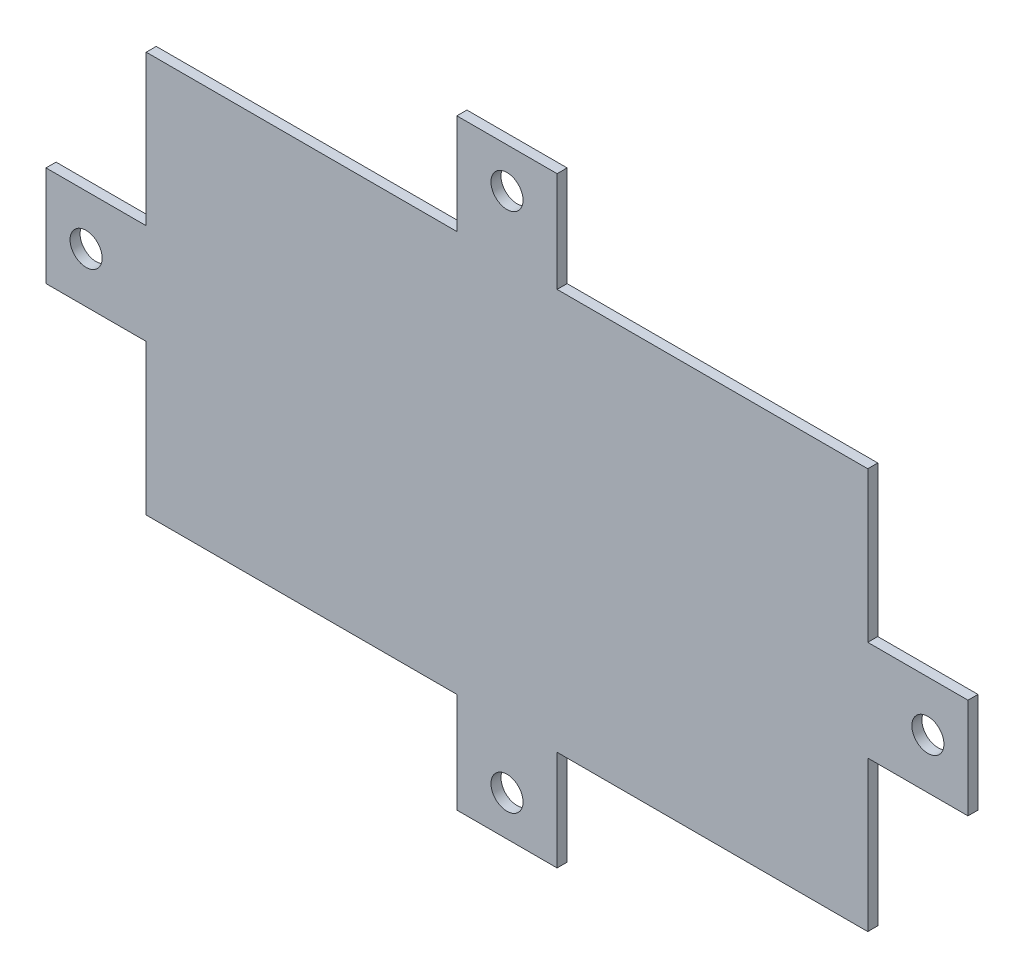
ISO-10303-21;
HEADER;
FILE_DESCRIPTION(('STEP AP214'),'2;1');
FILE_NAME('part.step','',(''),(''),'','','');
FILE_SCHEMA(('AUTOMOTIVE_DESIGN { 1 0 10303 214 1 1 1 1 }'));
ENDSEC;
DATA;
#1=APPLICATION_CONTEXT('core data for automotive mechanical design processes');
#2=APPLICATION_PROTOCOL_DEFINITION('international standard','automotive_design',2000,#1);
#3=PRODUCT_CONTEXT('',#1,'mechanical');
#4=PRODUCT('Part','Part','',(#3));
#5=PRODUCT_RELATED_PRODUCT_CATEGORY('part','',(#4));
#6=PRODUCT_DEFINITION_FORMATION('','',#4);
#7=PRODUCT_DEFINITION_CONTEXT('part definition',#1,'design');
#8=PRODUCT_DEFINITION('design','',#6,#7);
#9=PRODUCT_DEFINITION_SHAPE('','',#8);
#10=(LENGTH_UNIT() NAMED_UNIT(*) SI_UNIT(.MILLI.,.METRE.));
#11=(NAMED_UNIT(*) PLANE_ANGLE_UNIT() SI_UNIT($,.RADIAN.));
#12=(NAMED_UNIT(*) SI_UNIT($,.STERADIAN.) SOLID_ANGLE_UNIT());
#13=UNCERTAINTY_MEASURE_WITH_UNIT(LENGTH_MEASURE(1.E-05),#10,'distance_accuracy_value','');
#14=(GEOMETRIC_REPRESENTATION_CONTEXT(3) GLOBAL_UNCERTAINTY_ASSIGNED_CONTEXT((#13)) GLOBAL_UNIT_ASSIGNED_CONTEXT((#10,
#11,#12)) REPRESENTATION_CONTEXT('',''));
#15=CARTESIAN_POINT('',(0.,0.,0.));
#16=DIRECTION('',(0.,0.,1.));
#17=DIRECTION('',(1.,0.,0.));
#18=AXIS2_PLACEMENT_3D('',#15,#16,#17);
#19=CARTESIAN_POINT('',(0.,0.,0.));
#20=DIRECTION('',(0.,0.,1.));
#21=DIRECTION('',(1.,0.,0.));
#22=AXIS2_PLACEMENT_3D('',#19,#20,#21);
#23=PLANE('',#22);
#24=CARTESIAN_POINT('',(0.,26.,0.));
#25=DIRECTION('',(0.,0.,-1.));
#26=DIRECTION('',(-1.,0.,0.));
#27=AXIS2_PLACEMENT_3D('',#24,#25,#26);
#28=CIRCLE('',#27,1.6);
#29=CARTESIAN_POINT('',(-1.6,26.,0.));
#30=VERTEX_POINT('',#29);
#31=EDGE_CURVE('E185',#30,#30,#28,.F.);
#32=ORIENTED_EDGE('',*,*,#31,.T.);
#33=EDGE_LOOP('',(#32));
#34=FACE_BOUND('',#33,.T.);
#35=CARTESIAN_POINT('',(0.,-26.,0.));
#36=DIRECTION('',(0.,0.,-1.));
#37=DIRECTION('',(-1.,0.,0.));
#38=AXIS2_PLACEMENT_3D('',#35,#36,#37);
#39=CIRCLE('',#38,1.6);
#40=CARTESIAN_POINT('',(-1.6,-26.,0.));
#41=VERTEX_POINT('',#40);
#42=EDGE_CURVE('E189',#41,#41,#39,.F.);
#43=ORIENTED_EDGE('',*,*,#42,.T.);
#44=EDGE_LOOP('',(#43));
#45=FACE_BOUND('',#44,.T.);
#46=CARTESIAN_POINT('',(-42.,0.,0.));
#47=DIRECTION('',(0.,0.,-1.));
#48=DIRECTION('',(-1.,0.,0.));
#49=AXIS2_PLACEMENT_3D('',#46,#47,#48);
#50=CIRCLE('',#49,1.6);
#51=CARTESIAN_POINT('',(-43.6,0.,0.));
#52=VERTEX_POINT('',#51);
#53=EDGE_CURVE('E191',#52,#52,#50,.F.);
#54=ORIENTED_EDGE('',*,*,#53,.T.);
#55=EDGE_LOOP('',(#54));
#56=FACE_BOUND('',#55,.T.);
#57=CARTESIAN_POINT('',(42.,0.,0.));
#58=DIRECTION('',(0.,0.,-1.));
#59=DIRECTION('',(-1.,0.,0.));
#60=AXIS2_PLACEMENT_3D('',#57,#58,#59);
#61=CIRCLE('',#60,1.6);
#62=CARTESIAN_POINT('',(40.4,0.,0.));
#63=VERTEX_POINT('',#62);
#64=EDGE_CURVE('E19',#63,#63,#61,.F.);
#65=ORIENTED_EDGE('',*,*,#64,.T.);
#66=EDGE_LOOP('',(#65));
#67=FACE_BOUND('',#66,.T.);
#68=DIRECTION('',(0.,-1.,0.));
#69=VECTOR('',#68,1.);
#70=CARTESIAN_POINT('',(-5.,30.,0.));
#71=LINE('',#70,#69);
#72=CARTESIAN_POINT('',(-5.,30.,0.));
#73=VERTEX_POINT('',#72);
#74=CARTESIAN_POINT('',(-5.,20.,0.));
#75=VERTEX_POINT('',#74);
#76=EDGE_CURVE('E287',#73,#75,#71,.T.);
#77=ORIENTED_EDGE('',*,*,#76,.F.);
#78=DIRECTION('',(1.,0.,0.));
#79=VECTOR('',#78,1.);
#80=CARTESIAN_POINT('',(5.,30.,0.));
#81=LINE('',#80,#79);
#82=CARTESIAN_POINT('',(5.,30.,0.));
#83=VERTEX_POINT('',#82);
#84=EDGE_CURVE('E292',#83,#73,#81,.F.);
#85=ORIENTED_EDGE('',*,*,#84,.F.);
#86=DIRECTION('',(0.,1.,0.));
#87=VECTOR('',#86,1.);
#88=CARTESIAN_POINT('',(5.,20.,0.));
#89=LINE('',#88,#87);
#90=CARTESIAN_POINT('',(5.,20.,0.));
#91=VERTEX_POINT('',#90);
#92=EDGE_CURVE('E151',#91,#83,#89,.T.);
#93=ORIENTED_EDGE('',*,*,#92,.F.);
#94=DIRECTION('',(1.,0.,0.));
#95=VECTOR('',#94,1.);
#96=CARTESIAN_POINT('',(-36.,20.,0.));
#97=LINE('',#96,#95);
#98=CARTESIAN_POINT('',(36.,20.,0.));
#99=VERTEX_POINT('',#98);
#100=EDGE_CURVE('E165',#99,#91,#97,.F.);
#101=ORIENTED_EDGE('',*,*,#100,.F.);
#102=DIRECTION('',(0.,1.,0.));
#103=VECTOR('',#102,1.);
#104=CARTESIAN_POINT('',(36.,20.,0.));
#105=LINE('',#104,#103);
#106=CARTESIAN_POINT('',(36.,5.,0.));
#107=VERTEX_POINT('',#106);
#108=EDGE_CURVE('E156',#107,#99,#105,.T.);
#109=ORIENTED_EDGE('',*,*,#108,.F.);
#110=DIRECTION('',(-1.,0.,0.));
#111=VECTOR('',#110,1.);
#112=CARTESIAN_POINT('',(46.,5.,0.));
#113=LINE('',#112,#111);
#114=CARTESIAN_POINT('',(46.,5.,0.));
#115=VERTEX_POINT('',#114);
#116=EDGE_CURVE('E200',#115,#107,#113,.T.);
#117=ORIENTED_EDGE('',*,*,#116,.F.);
#118=DIRECTION('',(0.,1.,0.));
#119=VECTOR('',#118,1.);
#120=CARTESIAN_POINT('',(46.,-5.,0.));
#121=LINE('',#120,#119);
#122=CARTESIAN_POINT('',(46.,-5.,0.));
#123=VERTEX_POINT('',#122);
#124=EDGE_CURVE('E209',#123,#115,#121,.T.);
#125=ORIENTED_EDGE('',*,*,#124,.F.);
#126=DIRECTION('',(1.,0.,0.));
#127=VECTOR('',#126,1.);
#128=CARTESIAN_POINT('',(36.,-5.,0.));
#129=LINE('',#128,#127);
#130=CARTESIAN_POINT('',(36.,-5.,0.));
#131=VERTEX_POINT('',#130);
#132=EDGE_CURVE('E214',#131,#123,#129,.T.);
#133=ORIENTED_EDGE('',*,*,#132,.F.);
#134=DIRECTION('',(0.,1.,0.));
#135=VECTOR('',#134,1.);
#136=CARTESIAN_POINT('',(36.,20.,0.));
#137=LINE('',#136,#135);
#138=CARTESIAN_POINT('',(36.,-20.,0.));
#139=VERTEX_POINT('',#138);
#140=EDGE_CURVE('E217',#139,#131,#137,.T.);
#141=ORIENTED_EDGE('',*,*,#140,.F.);
#142=DIRECTION('',(1.,0.,0.));
#143=VECTOR('',#142,1.);
#144=CARTESIAN_POINT('',(36.,-20.,0.));
#145=LINE('',#144,#143);
#146=CARTESIAN_POINT('',(5.,-20.,0.));
#147=VERTEX_POINT('',#146);
#148=EDGE_CURVE('E223',#147,#139,#145,.T.);
#149=ORIENTED_EDGE('',*,*,#148,.F.);
#150=DIRECTION('',(0.,1.,0.));
#151=VECTOR('',#150,1.);
#152=CARTESIAN_POINT('',(5.,-30.,0.));
#153=LINE('',#152,#151);
#154=CARTESIAN_POINT('',(5.,-30.,0.));
#155=VERTEX_POINT('',#154);
#156=EDGE_CURVE('E231',#155,#147,#153,.T.);
#157=ORIENTED_EDGE('',*,*,#156,.F.);
#158=DIRECTION('',(1.,0.,0.));
#159=VECTOR('',#158,1.);
#160=CARTESIAN_POINT('',(-5.,-30.,0.));
#161=LINE('',#160,#159);
#162=CARTESIAN_POINT('',(-5.,-30.,0.));
#163=VERTEX_POINT('',#162);
#164=EDGE_CURVE('E236',#163,#155,#161,.T.);
#165=ORIENTED_EDGE('',*,*,#164,.F.);
#166=DIRECTION('',(0.,-1.,0.));
#167=VECTOR('',#166,1.);
#168=CARTESIAN_POINT('',(-5.,-20.,0.));
#169=LINE('',#168,#167);
#170=CARTESIAN_POINT('',(-5.,-20.,0.));
#171=VERTEX_POINT('',#170);
#172=EDGE_CURVE('E242',#171,#163,#169,.T.);
#173=ORIENTED_EDGE('',*,*,#172,.F.);
#174=DIRECTION('',(1.,0.,0.));
#175=VECTOR('',#174,1.);
#176=CARTESIAN_POINT('',(36.,-20.,0.));
#177=LINE('',#176,#175);
#178=CARTESIAN_POINT('',(-36.,-20.,0.));
#179=VERTEX_POINT('',#178);
#180=EDGE_CURVE('E245',#179,#171,#177,.T.);
#181=ORIENTED_EDGE('',*,*,#180,.F.);
#182=DIRECTION('',(0.,-1.,0.));
#183=VECTOR('',#182,1.);
#184=CARTESIAN_POINT('',(-36.,-20.,0.));
#185=LINE('',#184,#183);
#186=CARTESIAN_POINT('',(-36.,-5.,0.));
#187=VERTEX_POINT('',#186);
#188=EDGE_CURVE('E251',#187,#179,#185,.T.);
#189=ORIENTED_EDGE('',*,*,#188,.F.);
#190=DIRECTION('',(1.,0.,0.));
#191=VECTOR('',#190,1.);
#192=CARTESIAN_POINT('',(-46.,-5.,0.));
#193=LINE('',#192,#191);
#194=CARTESIAN_POINT('',(-46.,-5.,0.));
#195=VERTEX_POINT('',#194);
#196=EDGE_CURVE('E259',#195,#187,#193,.T.);
#197=ORIENTED_EDGE('',*,*,#196,.F.);
#198=DIRECTION('',(0.,-1.,0.));
#199=VECTOR('',#198,1.);
#200=CARTESIAN_POINT('',(-46.,5.,0.));
#201=LINE('',#200,#199);
#202=CARTESIAN_POINT('',(-46.,5.,0.));
#203=VERTEX_POINT('',#202);
#204=EDGE_CURVE('E264',#203,#195,#201,.T.);
#205=ORIENTED_EDGE('',*,*,#204,.F.);
#206=DIRECTION('',(-1.,0.,0.));
#207=VECTOR('',#206,1.);
#208=CARTESIAN_POINT('',(-36.,5.,0.));
#209=LINE('',#208,#207);
#210=CARTESIAN_POINT('',(-36.,5.,0.));
#211=VERTEX_POINT('',#210);
#212=EDGE_CURVE('E270',#211,#203,#209,.T.);
#213=ORIENTED_EDGE('',*,*,#212,.F.);
#214=DIRECTION('',(0.,-1.,0.));
#215=VECTOR('',#214,1.);
#216=CARTESIAN_POINT('',(-36.,-20.,0.));
#217=LINE('',#216,#215);
#218=CARTESIAN_POINT('',(-36.,20.,0.));
#219=VERTEX_POINT('',#218);
#220=EDGE_CURVE('E273',#219,#211,#217,.T.);
#221=ORIENTED_EDGE('',*,*,#220,.F.);
#222=DIRECTION('',(1.,0.,0.));
#223=VECTOR('',#222,1.);
#224=CARTESIAN_POINT('',(-36.,20.,0.));
#225=LINE('',#224,#223);
#226=EDGE_CURVE('E279',#75,#219,#225,.F.);
#227=ORIENTED_EDGE('',*,*,#226,.F.);
#228=EDGE_LOOP('',(#77,#85,#93,#101,#109,#117,#125,#133,#141,#149,#157,#165,#173,#181,#189,#197,
#205,#213,#221,#227));
#229=FACE_BOUND('',#228,.T.);
#230=ADVANCED_FACE('F16',(#34,#45,#56,#67,#229),#23,.F.);
#231=CARTESIAN_POINT('',(36.,20.,0.));
#232=DIRECTION('',(1.,0.,0.));
#233=DIRECTION('',(0.,1.,0.));
#234=AXIS2_PLACEMENT_3D('',#231,#232,#233);
#235=PLANE('',#234);
#236=DIRECTION('',(0.,0.,1.));
#237=VECTOR('',#236,1.);
#238=CARTESIAN_POINT('',(36.,20.,0.));
#239=LINE('',#238,#237);
#240=CARTESIAN_POINT('',(36.,20.,1.));
#241=VERTEX_POINT('',#240);
#242=EDGE_CURVE('E159',#241,#99,#239,.F.);
#243=ORIENTED_EDGE('',*,*,#242,.F.);
#244=DIRECTION('',(0.,1.,0.));
#245=VECTOR('',#244,1.);
#246=CARTESIAN_POINT('',(36.,0.,1.));
#247=LINE('',#246,#245);
#248=CARTESIAN_POINT('',(36.,5.,1.));
#249=VERTEX_POINT('',#248);
#250=EDGE_CURVE('E188',#249,#241,#247,.T.);
#251=ORIENTED_EDGE('',*,*,#250,.F.);
#252=DIRECTION('',(0.,0.,1.));
#253=VECTOR('',#252,1.);
#254=CARTESIAN_POINT('',(36.,5.,1.));
#255=LINE('',#254,#253);
#256=EDGE_CURVE('E162',#107,#249,#255,.T.);
#257=ORIENTED_EDGE('',*,*,#256,.F.);
#258=ORIENTED_EDGE('',*,*,#108,.T.);
#259=EDGE_LOOP('',(#243,#251,#257,#258));
#260=FACE_BOUND('',#259,.T.);
#261=ADVANCED_FACE('F157',(#260),#235,.T.);
#262=CARTESIAN_POINT('',(-36.,20.,0.));
#263=DIRECTION('',(0.,1.,0.));
#264=DIRECTION('',(0.,0.,1.));
#265=AXIS2_PLACEMENT_3D('',#262,#263,#264);
#266=PLANE('',#265);
#267=ORIENTED_EDGE('',*,*,#242,.T.);
#268=ORIENTED_EDGE('',*,*,#100,.T.);
#269=DIRECTION('',(0.,0.,1.));
#270=VECTOR('',#269,1.);
#271=CARTESIAN_POINT('',(5.,20.,1.));
#272=LINE('',#271,#270);
#273=CARTESIAN_POINT('',(5.,20.,1.));
#274=VERTEX_POINT('',#273);
#275=EDGE_CURVE('E295',#274,#91,#272,.F.);
#276=ORIENTED_EDGE('',*,*,#275,.F.);
#277=DIRECTION('',(1.,0.,0.));
#278=VECTOR('',#277,1.);
#279=CARTESIAN_POINT('',(0.,20.,1.));
#280=LINE('',#279,#278);
#281=EDGE_CURVE('E171',#241,#274,#280,.F.);
#282=ORIENTED_EDGE('',*,*,#281,.F.);
#283=EDGE_LOOP('',(#267,#268,#276,#282));
#284=FACE_BOUND('',#283,.T.);
#285=ADVANCED_FACE('F169',(#284),#266,.T.);
#286=CARTESIAN_POINT('',(5.,20.,1.));
#287=DIRECTION('',(1.,0.,0.));
#288=DIRECTION('',(0.,1.,0.));
#289=AXIS2_PLACEMENT_3D('',#286,#287,#288);
#290=PLANE('',#289);
#291=DIRECTION('',(0.,1.,0.));
#292=VECTOR('',#291,1.);
#293=CARTESIAN_POINT('',(5.,0.,1.));
#294=LINE('',#293,#292);
#295=CARTESIAN_POINT('',(5.,30.,1.));
#296=VERTEX_POINT('',#295);
#297=EDGE_CURVE('E309',#274,#296,#294,.T.);
#298=ORIENTED_EDGE('',*,*,#297,.F.);
#299=ORIENTED_EDGE('',*,*,#275,.T.);
#300=ORIENTED_EDGE('',*,*,#92,.T.);
#301=DIRECTION('',(0.,0.,1.));
#302=VECTOR('',#301,1.);
#303=CARTESIAN_POINT('',(5.,30.,1.));
#304=LINE('',#303,#302);
#305=EDGE_CURVE('E289',#296,#83,#304,.F.);
#306=ORIENTED_EDGE('',*,*,#305,.F.);
#307=EDGE_LOOP('',(#298,#299,#300,#306));
#308=FACE_BOUND('',#307,.T.);
#309=ADVANCED_FACE('F298',(#308),#290,.T.);
#310=CARTESIAN_POINT('',(5.,30.,1.));
#311=DIRECTION('',(0.,1.,0.));
#312=DIRECTION('',(0.,0.,1.));
#313=AXIS2_PLACEMENT_3D('',#310,#311,#312);
#314=PLANE('',#313);
#315=DIRECTION('',(1.,0.,0.));
#316=VECTOR('',#315,1.);
#317=CARTESIAN_POINT('',(0.,30.,1.));
#318=LINE('',#317,#316);
#319=CARTESIAN_POINT('',(-5.,30.,1.));
#320=VERTEX_POINT('',#319);
#321=EDGE_CURVE('E303',#296,#320,#318,.F.);
#322=ORIENTED_EDGE('',*,*,#321,.F.);
#323=ORIENTED_EDGE('',*,*,#305,.T.);
#324=ORIENTED_EDGE('',*,*,#84,.T.);
#325=DIRECTION('',(0.,0.,1.));
#326=VECTOR('',#325,1.);
#327=CARTESIAN_POINT('',(-5.,30.,1.));
#328=LINE('',#327,#326);
#329=EDGE_CURVE('E284',#320,#73,#328,.F.);
#330=ORIENTED_EDGE('',*,*,#329,.F.);
#331=EDGE_LOOP('',(#322,#323,#324,#330));
#332=FACE_BOUND('',#331,.T.);
#333=ADVANCED_FACE('F301',(#332),#314,.T.);
#334=CARTESIAN_POINT('',(-5.,30.,1.));
#335=DIRECTION('',(-1.,0.,0.));
#336=DIRECTION('',(0.,-1.,0.));
#337=AXIS2_PLACEMENT_3D('',#334,#335,#336);
#338=PLANE('',#337);
#339=DIRECTION('',(0.,1.,0.));
#340=VECTOR('',#339,1.);
#341=CARTESIAN_POINT('',(-5.,0.,1.));
#342=LINE('',#341,#340);
#343=CARTESIAN_POINT('',(-5.,20.,1.));
#344=VERTEX_POINT('',#343);
#345=EDGE_CURVE('E308',#320,#344,#342,.F.);
#346=ORIENTED_EDGE('',*,*,#345,.F.);
#347=ORIENTED_EDGE('',*,*,#329,.T.);
#348=ORIENTED_EDGE('',*,*,#76,.T.);
#349=DIRECTION('',(0.,0.,1.));
#350=VECTOR('',#349,1.);
#351=CARTESIAN_POINT('',(-5.,20.,0.));
#352=LINE('',#351,#350);
#353=EDGE_CURVE('E281',#344,#75,#352,.F.);
#354=ORIENTED_EDGE('',*,*,#353,.F.);
#355=EDGE_LOOP('',(#346,#347,#348,#354));
#356=FACE_BOUND('',#355,.T.);
#357=ADVANCED_FACE('F406',(#356),#338,.T.);
#358=CARTESIAN_POINT('',(-36.,20.,0.));
#359=DIRECTION('',(0.,1.,0.));
#360=DIRECTION('',(0.,0.,1.));
#361=AXIS2_PLACEMENT_3D('',#358,#359,#360);
#362=PLANE('',#361);
#363=DIRECTION('',(0.,0.,1.));
#364=VECTOR('',#363,1.);
#365=CARTESIAN_POINT('',(-36.,20.,0.));
#366=LINE('',#365,#364);
#367=CARTESIAN_POINT('',(-36.,20.,1.));
#368=VERTEX_POINT('',#367);
#369=EDGE_CURVE('E276',#368,#219,#366,.F.);
#370=ORIENTED_EDGE('',*,*,#369,.F.);
#371=DIRECTION('',(1.,0.,0.));
#372=VECTOR('',#371,1.);
#373=CARTESIAN_POINT('',(0.,20.,1.));
#374=LINE('',#373,#372);
#375=EDGE_CURVE('E316',#344,#368,#374,.F.);
#376=ORIENTED_EDGE('',*,*,#375,.F.);
#377=ORIENTED_EDGE('',*,*,#353,.T.);
#378=ORIENTED_EDGE('',*,*,#226,.T.);
#379=EDGE_LOOP('',(#370,#376,#377,#378));
#380=FACE_BOUND('',#379,.T.);
#381=ADVANCED_FACE('F404',(#380),#362,.T.);
#382=CARTESIAN_POINT('',(-36.,-20.,0.));
#383=DIRECTION('',(-1.,0.,0.));
#384=DIRECTION('',(0.,-1.,0.));
#385=AXIS2_PLACEMENT_3D('',#382,#383,#384);
#386=PLANE('',#385);
#387=ORIENTED_EDGE('',*,*,#369,.T.);
#388=ORIENTED_EDGE('',*,*,#220,.T.);
#389=DIRECTION('',(0.,0.,1.));
#390=VECTOR('',#389,1.);
#391=CARTESIAN_POINT('',(-36.,5.,1.));
#392=LINE('',#391,#390);
#393=CARTESIAN_POINT('',(-36.,5.,1.));
#394=VERTEX_POINT('',#393);
#395=EDGE_CURVE('E267',#394,#211,#392,.F.);
#396=ORIENTED_EDGE('',*,*,#395,.F.);
#397=DIRECTION('',(0.,1.,0.));
#398=VECTOR('',#397,1.);
#399=CARTESIAN_POINT('',(-36.,0.,1.));
#400=LINE('',#399,#398);
#401=EDGE_CURVE('E319',#368,#394,#400,.F.);
#402=ORIENTED_EDGE('',*,*,#401,.F.);
#403=EDGE_LOOP('',(#387,#388,#396,#402));
#404=FACE_BOUND('',#403,.T.);
#405=ADVANCED_FACE('F401',(#404),#386,.T.);
#406=CARTESIAN_POINT('',(-36.,5.,1.));
#407=DIRECTION('',(0.,1.,0.));
#408=DIRECTION('',(-1.,0.,0.));
#409=AXIS2_PLACEMENT_3D('',#406,#407,#408);
#410=PLANE('',#409);
#411=DIRECTION('',(1.,0.,0.));
#412=VECTOR('',#411,1.);
#413=CARTESIAN_POINT('',(0.,5.,1.));
#414=LINE('',#413,#412);
#415=CARTESIAN_POINT('',(-46.,5.,1.));
#416=VERTEX_POINT('',#415);
#417=EDGE_CURVE('E322',#394,#416,#414,.F.);
#418=ORIENTED_EDGE('',*,*,#417,.F.);
#419=ORIENTED_EDGE('',*,*,#395,.T.);
#420=ORIENTED_EDGE('',*,*,#212,.T.);
#421=DIRECTION('',(0.,0.,1.));
#422=VECTOR('',#421,1.);
#423=CARTESIAN_POINT('',(-46.,5.,1.));
#424=LINE('',#423,#422);
#425=EDGE_CURVE('E261',#416,#203,#424,.F.);
#426=ORIENTED_EDGE('',*,*,#425,.F.);
#427=EDGE_LOOP('',(#418,#419,#420,#426));
#428=FACE_BOUND('',#427,.T.);
#429=ADVANCED_FACE('F397',(#428),#410,.T.);
#430=CARTESIAN_POINT('',(-46.,5.,1.));
#431=DIRECTION('',(-1.,0.,0.));
#432=DIRECTION('',(0.,-1.,0.));
#433=AXIS2_PLACEMENT_3D('',#430,#431,#432);
#434=PLANE('',#433);
#435=DIRECTION('',(0.,1.,0.));
#436=VECTOR('',#435,1.);
#437=CARTESIAN_POINT('',(-46.,0.,1.));
#438=LINE('',#437,#436);
#439=CARTESIAN_POINT('',(-46.,-5.,1.));
#440=VERTEX_POINT('',#439);
#441=EDGE_CURVE('E325',#416,#440,#438,.F.);
#442=ORIENTED_EDGE('',*,*,#441,.F.);
#443=ORIENTED_EDGE('',*,*,#425,.T.);
#444=ORIENTED_EDGE('',*,*,#204,.T.);
#445=DIRECTION('',(0.,0.,-1.));
#446=VECTOR('',#445,1.);
#447=CARTESIAN_POINT('',(-46.,-5.,1.));
#448=LINE('',#447,#446);
#449=EDGE_CURVE('E256',#440,#195,#448,.T.);
#450=ORIENTED_EDGE('',*,*,#449,.F.);
#451=EDGE_LOOP('',(#442,#443,#444,#450));
#452=FACE_BOUND('',#451,.T.);
#453=ADVANCED_FACE('F391',(#452),#434,.T.);
#454=CARTESIAN_POINT('',(-46.,-5.,1.));
#455=DIRECTION('',(0.,-1.,0.));
#456=DIRECTION('',(0.,0.,-1.));
#457=AXIS2_PLACEMENT_3D('',#454,#455,#456);
#458=PLANE('',#457);
#459=DIRECTION('',(1.,0.,0.));
#460=VECTOR('',#459,1.);
#461=CARTESIAN_POINT('',(0.,-5.,1.));
#462=LINE('',#461,#460);
#463=CARTESIAN_POINT('',(-36.,-5.,1.));
#464=VERTEX_POINT('',#463);
#465=EDGE_CURVE('E328',#440,#464,#462,.T.);
#466=ORIENTED_EDGE('',*,*,#465,.F.);
#467=ORIENTED_EDGE('',*,*,#449,.T.);
#468=ORIENTED_EDGE('',*,*,#196,.T.);
#469=DIRECTION('',(0.,0.,1.));
#470=VECTOR('',#469,1.);
#471=CARTESIAN_POINT('',(-36.,-5.,0.));
#472=LINE('',#471,#470);
#473=EDGE_CURVE('E253',#464,#187,#472,.F.);
#474=ORIENTED_EDGE('',*,*,#473,.F.);
#475=EDGE_LOOP('',(#466,#467,#468,#474));
#476=FACE_BOUND('',#475,.T.);
#477=ADVANCED_FACE('F393',(#476),#458,.T.);
#478=CARTESIAN_POINT('',(-36.,-20.,0.));
#479=DIRECTION('',(-1.,0.,0.));
#480=DIRECTION('',(0.,-1.,0.));
#481=AXIS2_PLACEMENT_3D('',#478,#479,#480);
#482=PLANE('',#481);
#483=DIRECTION('',(0.,0.,1.));
#484=VECTOR('',#483,1.);
#485=CARTESIAN_POINT('',(-36.,-20.,0.));
#486=LINE('',#485,#484);
#487=CARTESIAN_POINT('',(-36.,-20.,1.));
#488=VERTEX_POINT('',#487);
#489=EDGE_CURVE('E248',#488,#179,#486,.F.);
#490=ORIENTED_EDGE('',*,*,#489,.F.);
#491=DIRECTION('',(0.,1.,0.));
#492=VECTOR('',#491,1.);
#493=CARTESIAN_POINT('',(-36.,0.,1.));
#494=LINE('',#493,#492);
#495=EDGE_CURVE('E331',#464,#488,#494,.F.);
#496=ORIENTED_EDGE('',*,*,#495,.F.);
#497=ORIENTED_EDGE('',*,*,#473,.T.);
#498=ORIENTED_EDGE('',*,*,#188,.T.);
#499=EDGE_LOOP('',(#490,#496,#497,#498));
#500=FACE_BOUND('',#499,.T.);
#501=ADVANCED_FACE('F387',(#500),#482,.T.);
#502=CARTESIAN_POINT('',(36.,-20.,0.));
#503=DIRECTION('',(0.,-1.,0.));
#504=DIRECTION('',(1.,0.,0.));
#505=AXIS2_PLACEMENT_3D('',#502,#503,#504);
#506=PLANE('',#505);
#507=ORIENTED_EDGE('',*,*,#489,.T.);
#508=ORIENTED_EDGE('',*,*,#180,.T.);
#509=DIRECTION('',(0.,0.,1.));
#510=VECTOR('',#509,1.);
#511=CARTESIAN_POINT('',(-5.,-20.,1.));
#512=LINE('',#511,#510);
#513=CARTESIAN_POINT('',(-5.,-20.,1.));
#514=VERTEX_POINT('',#513);
#515=EDGE_CURVE('E239',#514,#171,#512,.F.);
#516=ORIENTED_EDGE('',*,*,#515,.F.);
#517=DIRECTION('',(1.,0.,0.));
#518=VECTOR('',#517,1.);
#519=CARTESIAN_POINT('',(0.,-20.,1.));
#520=LINE('',#519,#518);
#521=EDGE_CURVE('E334',#488,#514,#520,.T.);
#522=ORIENTED_EDGE('',*,*,#521,.F.);
#523=EDGE_LOOP('',(#507,#508,#516,#522));
#524=FACE_BOUND('',#523,.T.);
#525=ADVANCED_FACE('F384',(#524),#506,.T.);
#526=CARTESIAN_POINT('',(-5.,-20.,1.));
#527=DIRECTION('',(-1.,0.,0.));
#528=DIRECTION('',(0.,-1.,0.));
#529=AXIS2_PLACEMENT_3D('',#526,#527,#528);
#530=PLANE('',#529);
#531=DIRECTION('',(0.,1.,0.));
#532=VECTOR('',#531,1.);
#533=CARTESIAN_POINT('',(-5.,0.,1.));
#534=LINE('',#533,#532);
#535=CARTESIAN_POINT('',(-5.,-30.,1.));
#536=VERTEX_POINT('',#535);
#537=EDGE_CURVE('E337',#514,#536,#534,.F.);
#538=ORIENTED_EDGE('',*,*,#537,.F.);
#539=ORIENTED_EDGE('',*,*,#515,.T.);
#540=ORIENTED_EDGE('',*,*,#172,.T.);
#541=DIRECTION('',(0.,0.,-1.));
#542=VECTOR('',#541,1.);
#543=CARTESIAN_POINT('',(-5.,-30.,1.));
#544=LINE('',#543,#542);
#545=EDGE_CURVE('E233',#536,#163,#544,.T.);
#546=ORIENTED_EDGE('',*,*,#545,.F.);
#547=EDGE_LOOP('',(#538,#539,#540,#546));
#548=FACE_BOUND('',#547,.T.);
#549=ADVANCED_FACE('F380',(#548),#530,.T.);
#550=CARTESIAN_POINT('',(-5.,-30.,1.));
#551=DIRECTION('',(0.,-1.,0.));
#552=DIRECTION('',(0.,0.,-1.));
#553=AXIS2_PLACEMENT_3D('',#550,#551,#552);
#554=PLANE('',#553);
#555=DIRECTION('',(1.,0.,0.));
#556=VECTOR('',#555,1.);
#557=CARTESIAN_POINT('',(0.,-30.,1.));
#558=LINE('',#557,#556);
#559=CARTESIAN_POINT('',(5.,-30.,1.));
#560=VERTEX_POINT('',#559);
#561=EDGE_CURVE('E340',#536,#560,#558,.T.);
#562=ORIENTED_EDGE('',*,*,#561,.F.);
#563=ORIENTED_EDGE('',*,*,#545,.T.);
#564=ORIENTED_EDGE('',*,*,#164,.T.);
#565=DIRECTION('',(0.,0.,1.));
#566=VECTOR('',#565,1.);
#567=CARTESIAN_POINT('',(5.,-30.,1.));
#568=LINE('',#567,#566);
#569=EDGE_CURVE('E228',#560,#155,#568,.F.);
#570=ORIENTED_EDGE('',*,*,#569,.F.);
#571=EDGE_LOOP('',(#562,#563,#564,#570));
#572=FACE_BOUND('',#571,.T.);
#573=ADVANCED_FACE('F374',(#572),#554,.T.);
#574=CARTESIAN_POINT('',(5.,-30.,1.));
#575=DIRECTION('',(1.,0.,0.));
#576=DIRECTION('',(0.,1.,0.));
#577=AXIS2_PLACEMENT_3D('',#574,#575,#576);
#578=PLANE('',#577);
#579=DIRECTION('',(0.,1.,0.));
#580=VECTOR('',#579,1.);
#581=CARTESIAN_POINT('',(5.,0.,1.));
#582=LINE('',#581,#580);
#583=CARTESIAN_POINT('',(5.,-20.,1.));
#584=VERTEX_POINT('',#583);
#585=EDGE_CURVE('E343',#560,#584,#582,.T.);
#586=ORIENTED_EDGE('',*,*,#585,.F.);
#587=ORIENTED_EDGE('',*,*,#569,.T.);
#588=ORIENTED_EDGE('',*,*,#156,.T.);
#589=DIRECTION('',(0.,0.,1.));
#590=VECTOR('',#589,1.);
#591=CARTESIAN_POINT('',(5.,-20.,0.));
#592=LINE('',#591,#590);
#593=EDGE_CURVE('E225',#584,#147,#592,.F.);
#594=ORIENTED_EDGE('',*,*,#593,.F.);
#595=EDGE_LOOP('',(#586,#587,#588,#594));
#596=FACE_BOUND('',#595,.T.);
#597=ADVANCED_FACE('F376',(#596),#578,.T.);
#598=CARTESIAN_POINT('',(36.,-20.,0.));
#599=DIRECTION('',(0.,-1.,0.));
#600=DIRECTION('',(1.,0.,0.));
#601=AXIS2_PLACEMENT_3D('',#598,#599,#600);
#602=PLANE('',#601);
#603=DIRECTION('',(0.,0.,1.));
#604=VECTOR('',#603,1.);
#605=CARTESIAN_POINT('',(36.,-20.,0.));
#606=LINE('',#605,#604);
#607=CARTESIAN_POINT('',(36.,-20.,1.));
#608=VERTEX_POINT('',#607);
#609=EDGE_CURVE('E220',#608,#139,#606,.F.);
#610=ORIENTED_EDGE('',*,*,#609,.F.);
#611=DIRECTION('',(1.,0.,0.));
#612=VECTOR('',#611,1.);
#613=CARTESIAN_POINT('',(0.,-20.,1.));
#614=LINE('',#613,#612);
#615=EDGE_CURVE('E346',#584,#608,#614,.T.);
#616=ORIENTED_EDGE('',*,*,#615,.F.);
#617=ORIENTED_EDGE('',*,*,#593,.T.);
#618=ORIENTED_EDGE('',*,*,#148,.T.);
#619=EDGE_LOOP('',(#610,#616,#617,#618));
#620=FACE_BOUND('',#619,.T.);
#621=ADVANCED_FACE('F370',(#620),#602,.T.);
#622=CARTESIAN_POINT('',(36.,20.,0.));
#623=DIRECTION('',(1.,0.,0.));
#624=DIRECTION('',(0.,1.,0.));
#625=AXIS2_PLACEMENT_3D('',#622,#623,#624);
#626=PLANE('',#625);
#627=ORIENTED_EDGE('',*,*,#609,.T.);
#628=ORIENTED_EDGE('',*,*,#140,.T.);
#629=DIRECTION('',(0.,0.,-1.));
#630=VECTOR('',#629,1.);
#631=CARTESIAN_POINT('',(36.,-5.,1.));
#632=LINE('',#631,#630);
#633=CARTESIAN_POINT('',(36.,-5.,1.));
#634=VERTEX_POINT('',#633);
#635=EDGE_CURVE('E211',#634,#131,#632,.T.);
#636=ORIENTED_EDGE('',*,*,#635,.F.);
#637=DIRECTION('',(0.,1.,0.));
#638=VECTOR('',#637,1.);
#639=CARTESIAN_POINT('',(36.,0.,1.));
#640=LINE('',#639,#638);
#641=EDGE_CURVE('E349',#608,#634,#640,.T.);
#642=ORIENTED_EDGE('',*,*,#641,.F.);
#643=EDGE_LOOP('',(#627,#628,#636,#642));
#644=FACE_BOUND('',#643,.T.);
#645=ADVANCED_FACE('F366',(#644),#626,.T.);
#646=CARTESIAN_POINT('',(36.,-5.,1.));
#647=DIRECTION('',(0.,-1.,0.));
#648=DIRECTION('',(0.,0.,-1.));
#649=AXIS2_PLACEMENT_3D('',#646,#647,#648);
#650=PLANE('',#649);
#651=DIRECTION('',(1.,0.,0.));
#652=VECTOR('',#651,1.);
#653=CARTESIAN_POINT('',(0.,-5.,1.));
#654=LINE('',#653,#652);
#655=CARTESIAN_POINT('',(46.,-5.,1.));
#656=VERTEX_POINT('',#655);
#657=EDGE_CURVE('E352',#634,#656,#654,.T.);
#658=ORIENTED_EDGE('',*,*,#657,.F.);
#659=ORIENTED_EDGE('',*,*,#635,.T.);
#660=ORIENTED_EDGE('',*,*,#132,.T.);
#661=DIRECTION('',(0.,0.,1.));
#662=VECTOR('',#661,1.);
#663=CARTESIAN_POINT('',(46.,-5.,1.));
#664=LINE('',#663,#662);
#665=EDGE_CURVE('E206',#656,#123,#664,.F.);
#666=ORIENTED_EDGE('',*,*,#665,.F.);
#667=EDGE_LOOP('',(#658,#659,#660,#666));
#668=FACE_BOUND('',#667,.T.);
#669=ADVANCED_FACE('F362',(#668),#650,.T.);
#670=CARTESIAN_POINT('',(46.,-5.,1.));
#671=DIRECTION('',(1.,0.,0.));
#672=DIRECTION('',(0.,1.,0.));
#673=AXIS2_PLACEMENT_3D('',#670,#671,#672);
#674=PLANE('',#673);
#675=DIRECTION('',(0.,1.,0.));
#676=VECTOR('',#675,1.);
#677=CARTESIAN_POINT('',(46.,0.,1.));
#678=LINE('',#677,#676);
#679=CARTESIAN_POINT('',(46.,5.,1.));
#680=VERTEX_POINT('',#679);
#681=EDGE_CURVE('E355',#656,#680,#678,.T.);
#682=ORIENTED_EDGE('',*,*,#681,.F.);
#683=ORIENTED_EDGE('',*,*,#665,.T.);
#684=ORIENTED_EDGE('',*,*,#124,.T.);
#685=DIRECTION('',(0.,0.,1.));
#686=VECTOR('',#685,1.);
#687=CARTESIAN_POINT('',(46.,5.,1.));
#688=LINE('',#687,#686);
#689=EDGE_CURVE('E34',#680,#115,#688,.F.);
#690=ORIENTED_EDGE('',*,*,#689,.F.);
#691=EDGE_LOOP('',(#682,#683,#684,#690));
#692=FACE_BOUND('',#691,.T.);
#693=ADVANCED_FACE('F359',(#692),#674,.T.);
#694=CARTESIAN_POINT('',(46.,5.,1.));
#695=DIRECTION('',(0.,1.,0.));
#696=DIRECTION('',(-1.,0.,0.));
#697=AXIS2_PLACEMENT_3D('',#694,#695,#696);
#698=PLANE('',#697);
#699=DIRECTION('',(1.,0.,0.));
#700=VECTOR('',#699,1.);
#701=CARTESIAN_POINT('',(0.,5.,1.));
#702=LINE('',#701,#700);
#703=EDGE_CURVE('E184',#680,#249,#702,.F.);
#704=ORIENTED_EDGE('',*,*,#703,.F.);
#705=ORIENTED_EDGE('',*,*,#689,.T.);
#706=ORIENTED_EDGE('',*,*,#116,.T.);
#707=ORIENTED_EDGE('',*,*,#256,.T.);
#708=EDGE_LOOP('',(#704,#705,#706,#707));
#709=FACE_BOUND('',#708,.T.);
#710=ADVANCED_FACE('F358',(#709),#698,.T.);
#711=CARTESIAN_POINT('',(42.,0.,1.));
#712=DIRECTION('',(0.,0.,-1.));
#713=DIRECTION('',(-1.,0.,0.));
#714=AXIS2_PLACEMENT_3D('',#711,#712,#713);
#715=CYLINDRICAL_SURFACE('',#714,1.6);
#716=ORIENTED_EDGE('',*,*,#64,.F.);
#717=EDGE_LOOP('',(#716));
#718=FACE_BOUND('',#717,.T.);
#719=CARTESIAN_POINT('',(42.,0.,1.));
#720=DIRECTION('',(0.,0.,-1.));
#721=DIRECTION('',(-1.,0.,0.));
#722=AXIS2_PLACEMENT_3D('',#719,#720,#721);
#723=CIRCLE('',#722,1.6);
#724=CARTESIAN_POINT('',(40.4,0.,1.));
#725=VERTEX_POINT('',#724);
#726=EDGE_CURVE('E181',#725,#725,#723,.T.);
#727=ORIENTED_EDGE('',*,*,#726,.F.);
#728=EDGE_LOOP('',(#727));
#729=FACE_BOUND('',#728,.T.);
#730=ADVANCED_FACE('F434',(#718,#729),#715,.F.);
#731=CARTESIAN_POINT('',(-42.,0.,1.));
#732=DIRECTION('',(0.,0.,-1.));
#733=DIRECTION('',(-1.,0.,0.));
#734=AXIS2_PLACEMENT_3D('',#731,#732,#733);
#735=CYLINDRICAL_SURFACE('',#734,1.6);
#736=ORIENTED_EDGE('',*,*,#53,.F.);
#737=EDGE_LOOP('',(#736));
#738=FACE_BOUND('',#737,.T.);
#739=CARTESIAN_POINT('',(-42.,0.,1.));
#740=DIRECTION('',(0.,0.,-1.));
#741=DIRECTION('',(-1.,0.,0.));
#742=AXIS2_PLACEMENT_3D('',#739,#740,#741);
#743=CIRCLE('',#742,1.6);
#744=CARTESIAN_POINT('',(-43.6,0.,1.));
#745=VERTEX_POINT('',#744);
#746=EDGE_CURVE('E178',#745,#745,#743,.T.);
#747=ORIENTED_EDGE('',*,*,#746,.F.);
#748=EDGE_LOOP('',(#747));
#749=FACE_BOUND('',#748,.T.);
#750=ADVANCED_FACE('F430',(#738,#749),#735,.F.);
#751=CARTESIAN_POINT('',(0.,-26.,1.));
#752=DIRECTION('',(0.,0.,-1.));
#753=DIRECTION('',(-1.,0.,0.));
#754=AXIS2_PLACEMENT_3D('',#751,#752,#753);
#755=CYLINDRICAL_SURFACE('',#754,1.6);
#756=ORIENTED_EDGE('',*,*,#42,.F.);
#757=EDGE_LOOP('',(#756));
#758=FACE_BOUND('',#757,.T.);
#759=CARTESIAN_POINT('',(0.,-26.,1.));
#760=DIRECTION('',(0.,0.,-1.));
#761=DIRECTION('',(-1.,0.,0.));
#762=AXIS2_PLACEMENT_3D('',#759,#760,#761);
#763=CIRCLE('',#762,1.6);
#764=CARTESIAN_POINT('',(-1.6,-26.,1.));
#765=VERTEX_POINT('',#764);
#766=EDGE_CURVE('E25',#765,#765,#763,.T.);
#767=ORIENTED_EDGE('',*,*,#766,.F.);
#768=EDGE_LOOP('',(#767));
#769=FACE_BOUND('',#768,.T.);
#770=ADVANCED_FACE('F423',(#758,#769),#755,.F.);
#771=CARTESIAN_POINT('',(0.,26.,1.));
#772=DIRECTION('',(0.,0.,-1.));
#773=DIRECTION('',(-1.,0.,0.));
#774=AXIS2_PLACEMENT_3D('',#771,#772,#773);
#775=CYLINDRICAL_SURFACE('',#774,1.6);
#776=ORIENTED_EDGE('',*,*,#31,.F.);
#777=EDGE_LOOP('',(#776));
#778=FACE_BOUND('',#777,.T.);
#779=CARTESIAN_POINT('',(0.,26.,1.));
#780=DIRECTION('',(0.,0.,-1.));
#781=DIRECTION('',(-1.,0.,0.));
#782=AXIS2_PLACEMENT_3D('',#779,#780,#781);
#783=CIRCLE('',#782,1.6);
#784=CARTESIAN_POINT('',(-1.6,26.,1.));
#785=VERTEX_POINT('',#784);
#786=EDGE_CURVE('E11',#785,#785,#783,.T.);
#787=ORIENTED_EDGE('',*,*,#786,.F.);
#788=EDGE_LOOP('',(#787));
#789=FACE_BOUND('',#788,.T.);
#790=ADVANCED_FACE('F417',(#778,#789),#775,.F.);
#791=CARTESIAN_POINT('',(0.,0.,1.));
#792=DIRECTION('',(0.,0.,1.));
#793=DIRECTION('',(1.,0.,0.));
#794=AXIS2_PLACEMENT_3D('',#791,#792,#793);
#795=PLANE('',#794);
#796=ORIENTED_EDGE('',*,*,#786,.T.);
#797=EDGE_LOOP('',(#796));
#798=FACE_BOUND('',#797,.T.);
#799=ORIENTED_EDGE('',*,*,#766,.T.);
#800=EDGE_LOOP('',(#799));
#801=FACE_BOUND('',#800,.T.);
#802=ORIENTED_EDGE('',*,*,#746,.T.);
#803=EDGE_LOOP('',(#802));
#804=FACE_BOUND('',#803,.T.);
#805=ORIENTED_EDGE('',*,*,#726,.T.);
#806=EDGE_LOOP('',(#805));
#807=FACE_BOUND('',#806,.T.);
#808=ORIENTED_EDGE('',*,*,#681,.T.);
#809=ORIENTED_EDGE('',*,*,#703,.T.);
#810=ORIENTED_EDGE('',*,*,#250,.T.);
#811=ORIENTED_EDGE('',*,*,#281,.T.);
#812=ORIENTED_EDGE('',*,*,#297,.T.);
#813=ORIENTED_EDGE('',*,*,#321,.T.);
#814=ORIENTED_EDGE('',*,*,#345,.T.);
#815=ORIENTED_EDGE('',*,*,#375,.T.);
#816=ORIENTED_EDGE('',*,*,#401,.T.);
#817=ORIENTED_EDGE('',*,*,#417,.T.);
#818=ORIENTED_EDGE('',*,*,#441,.T.);
#819=ORIENTED_EDGE('',*,*,#465,.T.);
#820=ORIENTED_EDGE('',*,*,#495,.T.);
#821=ORIENTED_EDGE('',*,*,#521,.T.);
#822=ORIENTED_EDGE('',*,*,#537,.T.);
#823=ORIENTED_EDGE('',*,*,#561,.T.);
#824=ORIENTED_EDGE('',*,*,#585,.T.);
#825=ORIENTED_EDGE('',*,*,#615,.T.);
#826=ORIENTED_EDGE('',*,*,#641,.T.);
#827=ORIENTED_EDGE('',*,*,#657,.T.);
#828=EDGE_LOOP('',(#808,#809,#810,#811,#812,#813,#814,#815,#816,#817,#818,#819,#820,#821,#822,
#823,#824,#825,#826,#827));
#829=FACE_BOUND('',#828,.T.);
#830=ADVANCED_FACE('F312',(#798,#801,#804,#807,#829),#795,.T.);
#831=CLOSED_SHELL('',(#230,#261,#285,#309,#333,#357,#381,#405,#429,#453,#477,#501,#525,#549,
#573,#597,#621,#645,#669,#693,#710,#730,#750,#770,#790,#830));
#832=MANIFOLD_SOLID_BREP('B1',#831);
#833=ADVANCED_BREP_SHAPE_REPRESENTATION('',(#18,#832),#14);
#834=SHAPE_DEFINITION_REPRESENTATION(#9,#833);
ENDSEC;
END-ISO-10303-21;
